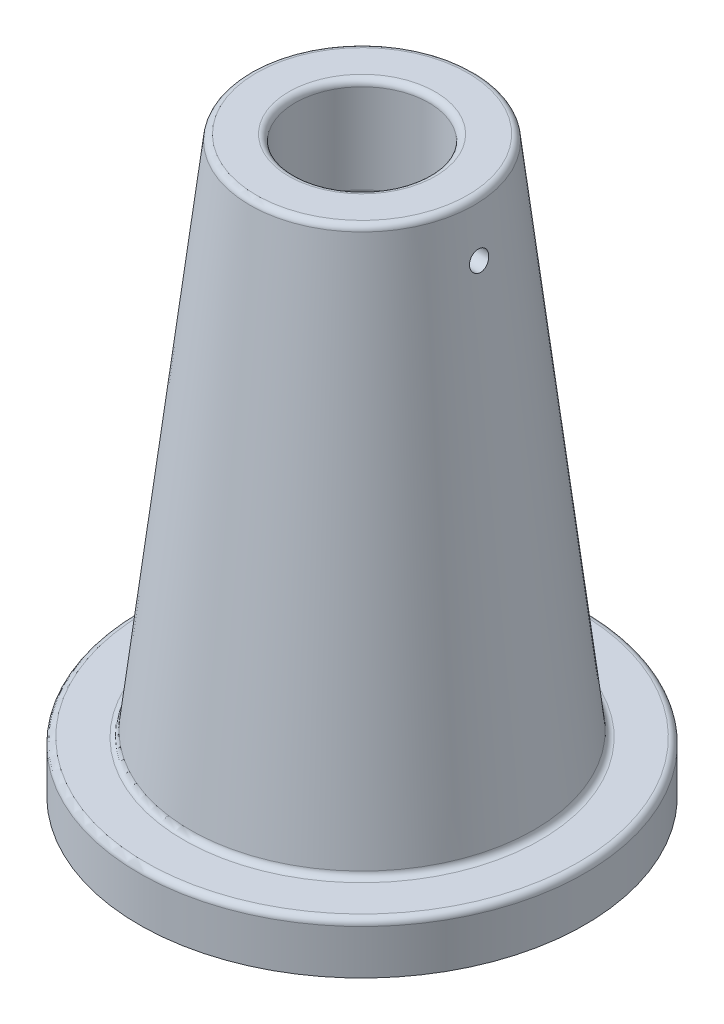
ISO-10303-21;
HEADER;
FILE_DESCRIPTION(('STEP AP214'),'2;1');
FILE_NAME('part.step','',(''),(''),'','','');
FILE_SCHEMA(('AUTOMOTIVE_DESIGN { 1 0 10303 214 1 1 1 1 }'));
ENDSEC;
DATA;
#1=APPLICATION_CONTEXT('core data for automotive mechanical design processes');
#2=APPLICATION_PROTOCOL_DEFINITION('international standard','automotive_design',2000,#1);
#3=PRODUCT_CONTEXT('',#1,'mechanical');
#4=PRODUCT('Part','Part','',(#3));
#5=PRODUCT_RELATED_PRODUCT_CATEGORY('part','',(#4));
#6=PRODUCT_DEFINITION_FORMATION('','',#4);
#7=PRODUCT_DEFINITION_CONTEXT('part definition',#1,'design');
#8=PRODUCT_DEFINITION('design','',#6,#7);
#9=PRODUCT_DEFINITION_SHAPE('','',#8);
#10=(LENGTH_UNIT() NAMED_UNIT(*) SI_UNIT(.MILLI.,.METRE.));
#11=(NAMED_UNIT(*) PLANE_ANGLE_UNIT() SI_UNIT($,.RADIAN.));
#12=(NAMED_UNIT(*) SI_UNIT($,.STERADIAN.) SOLID_ANGLE_UNIT());
#13=UNCERTAINTY_MEASURE_WITH_UNIT(LENGTH_MEASURE(1.E-05),#10,'distance_accuracy_value','');
#14=(GEOMETRIC_REPRESENTATION_CONTEXT(3) GLOBAL_UNCERTAINTY_ASSIGNED_CONTEXT((#13)) GLOBAL_UNIT_ASSIGNED_CONTEXT((#10,
#11,#12)) REPRESENTATION_CONTEXT('',''));
#15=CARTESIAN_POINT('',(0.,0.,0.));
#16=DIRECTION('',(0.,0.,1.));
#17=DIRECTION('',(1.,0.,0.));
#18=AXIS2_PLACEMENT_3D('',#15,#16,#17);
#19=CARTESIAN_POINT('',(0.,180.,0.));
#20=DIRECTION('',(0.,-1.,0.));
#21=DIRECTION('',(1.,0.,0.));
#22=AXIS2_PLACEMENT_3D('',#19,#20,#21);
#23=CONICAL_SURFACE('',#22,35.,0.116478140094217);
#24=CARTESIAN_POINT('',(0.,17.7675701216717,0.));
#25=DIRECTION('',(0.,-1.,0.));
#26=DIRECTION('',(1.,0.,0.));
#27=AXIS2_PLACEMENT_3D('',#24,#25,#26);
#28=CIRCLE('',#27,53.9824554264844);
#29=CARTESIAN_POINT('',(53.9824554264844,17.7675701216717,0.));
#30=VERTEX_POINT('',#29);
#31=EDGE_CURVE('E10',#30,#30,#28,.F.);
#32=ORIENTED_EDGE('',*,*,#31,.T.);
#33=EDGE_LOOP('',(#32));
#34=FACE_BOUND('',#33,.T.);
#35=CARTESIAN_POINT('',(0.,178.232429878328,0.));
#36=DIRECTION('',(0.,1.,0.));
#37=DIRECTION('',(-1.,0.,0.));
#38=AXIS2_PLACEMENT_3D('',#35,#36,#37);
#39=CIRCLE('',#38,35.2068194446263);
#40=CARTESIAN_POINT('',(-35.2068194446264,178.232429878328,0.));
#41=VERTEX_POINT('',#40);
#42=EDGE_CURVE('E44',#41,#41,#39,.F.);
#43=ORIENTED_EDGE('',*,*,#42,.T.);
#44=EDGE_LOOP('',(#43));
#45=FACE_BOUND('',#44,.T.);
#46=CARTESIAN_POINT('',(37.1195287037183,161.544046174723,-1.72287283645094));
#47=CARTESIAN_POINT('',(37.1370110141704,161.448667116111,-1.58689874380594));
#48=CARTESIAN_POINT('',(37.1528076429948,161.364442769678,-1.44275699277994));
#49=CARTESIAN_POINT('',(37.1800718568324,161.220883186217,-1.14206506275258));
#50=CARTESIAN_POINT('',(37.1915354072956,161.161571139466,-0.985503482852251));
#51=CARTESIAN_POINT('',(37.2094043683002,161.069731522951,-0.664384702451008));
#52=CARTESIAN_POINT('',(37.2158089231903,161.037208484097,-0.499826154379789));
#53=CARTESIAN_POINT('',(37.2231394596646,161.000018150022,-0.167507186579219));
#54=CARTESIAN_POINT('',(37.2240667284955,160.995344309809,0.000252471541381012));
#55=CARTESIAN_POINT('',(37.2204024855878,161.013900202914,0.332690136014836));
#56=CARTESIAN_POINT('',(37.2158588676727,161.036887778591,0.497382253536511));
#57=CARTESIAN_POINT('',(37.2016232561636,161.109637827107,0.820509060427897));
#58=CARTESIAN_POINT('',(37.1919310868643,161.159401213729,0.978943536043867));
#59=CARTESIAN_POINT('',(37.1679763085755,161.284308456691,1.2854852897461));
#60=CARTESIAN_POINT('',(37.1537039650398,161.35950638929,1.43356974645748));
#61=CARTESIAN_POINT('',(37.1214506252923,161.533029867042,1.71505123867367));
#62=CARTESIAN_POINT('',(37.1034693503597,161.63135715041,1.84844716920082));
#63=CARTESIAN_POINT('',(37.0645272496727,161.849990756925,2.09893036350318));
#64=CARTESIAN_POINT('',(37.0435256608058,161.970605543919,2.21574202003833));
#65=CARTESIAN_POINT('',(36.9999015094385,162.229416713766,2.42755090189932));
#66=CARTESIAN_POINT('',(36.9772788065398,162.367614620229,2.52254623479502));
#67=CARTESIAN_POINT('',(36.9312194794563,162.659977865549,2.6894399098405));
#68=CARTESIAN_POINT('',(36.9077757642353,162.814349274428,2.76097555881078));
#69=CARTESIAN_POINT('',(36.8615115870054,163.133034484778,2.87699983738788));
#70=CARTESIAN_POINT('',(36.8386911428328,163.297348570349,2.92148769373635));
#71=CARTESIAN_POINT('',(36.7945494894836,163.631930005524,2.98220233597654));
#72=CARTESIAN_POINT('',(36.7732338389751,163.802216270673,2.99832911566572));
#73=CARTESIAN_POINT('',(36.7329355023764,164.143331352233,3.00142379082487));
#74=CARTESIAN_POINT('',(36.7139527283342,164.31416014794,2.98839278593058));
#75=CARTESIAN_POINT('',(36.6789238812265,164.650223263936,2.93359725533705));
#76=CARTESIAN_POINT('',(36.6628582827522,164.815488253205,2.8920334059748));
#77=CARTESIAN_POINT('',(36.6337042033163,165.136840437871,2.78144988759185));
#78=CARTESIAN_POINT('',(36.6206155834114,165.292928061346,2.71243150035874));
#79=CARTESIAN_POINT('',(36.5974623290919,165.590069757848,2.54953824349799));
#80=CARTESIAN_POINT('',(36.5873731996491,165.731239174763,2.45587719676131));
#81=CARTESIAN_POINT('',(36.5698232073608,165.995923724751,2.24606460642692));
#82=CARTESIAN_POINT('',(36.5623622888959,166.11943923139,2.12991353885382));
#83=CARTESIAN_POINT('',(36.5497147573477,166.344797295062,1.87890082820036));
#84=CARTESIAN_POINT('',(36.5445196756086,166.446719808891,1.74411137982925));
#85=CARTESIAN_POINT('',(36.5359409479399,166.62654979379,1.45931421451841));
#86=CARTESIAN_POINT('',(36.5325572993548,166.704457300063,1.30930651988713));
#87=CARTESIAN_POINT('',(36.5272109497271,166.834022080924,0.998342965294474));
#88=CARTESIAN_POINT('',(36.5252481496774,166.885681184469,0.837387869021582));
#89=CARTESIAN_POINT('',(36.5224515711374,166.961284627812,0.509085595260116));
#90=CARTESIAN_POINT('',(36.5216177961011,166.985228882824,0.341738398218662));
#91=CARTESIAN_POINT('',(36.520935200251,167.004726697664,0.00529496317647928));
#92=CARTESIAN_POINT('',(36.5210869716184,167.000263188271,-0.163802265430194));
#93=CARTESIAN_POINT('',(36.5224041216861,166.963032429132,-0.498848003921515));
#94=CARTESIAN_POINT('',(36.5235695026616,166.930265115856,-0.664796506737668));
#95=CARTESIAN_POINT('',(36.5271083953451,166.837355228084,-0.98885266056172));
#96=CARTESIAN_POINT('',(36.5294820486821,166.777209444477,-1.1469593900025));
#97=CARTESIAN_POINT('',(36.535767231822,166.631261224011,-1.45081754963313));
#98=CARTESIAN_POINT('',(36.5396787539933,166.545458914473,-1.59656904113123));
#99=CARTESIAN_POINT('',(36.5494469072692,166.350702900898,-1.87151392836735));
#100=CARTESIAN_POINT('',(36.5553026890307,166.241759313521,-2.00071452021506));
#101=CARTESIAN_POINT('',(36.5693754419158,166.003837773683,-2.23896770527406));
#102=CARTESIAN_POINT('',(36.577592390578,165.874860011809,-2.34802049013255));
#103=CARTESIAN_POINT('',(36.5967245677539,165.600668044373,-2.54285926079753));
#104=CARTESIAN_POINT('',(36.6076384066268,165.455462221769,-2.62865718166677));
#105=CARTESIAN_POINT('',(36.6323576442558,165.152951084044,-2.77469178227036));
#106=CARTESIAN_POINT('',(36.6461630504673,164.995645737729,-2.83492839609791));
#107=CARTESIAN_POINT('',(36.6766733965209,164.673148300885,-2.92832819673883));
#108=CARTESIAN_POINT('',(36.6933836361169,164.507942202203,-2.96144125574067));
#109=CARTESIAN_POINT('',(36.7294159372367,164.174608393723,-2.999609380185));
#110=CARTESIAN_POINT('',(36.7487380001675,164.006480682352,-3.00466443051194));
#111=CARTESIAN_POINT('',(36.7896029410071,163.670882224423,-2.98665483596641));
#112=CARTESIAN_POINT('',(36.8111596650992,163.503423182112,-2.963403943892));
#113=CARTESIAN_POINT('',(36.8556148823772,163.174893564645,-2.88921541670958));
#114=CARTESIAN_POINT('',(36.8785137589471,163.013824837123,-2.83826983592553));
#115=CARTESIAN_POINT('',(36.9248825047814,162.701109465887,-2.70956553954884));
#116=CARTESIAN_POINT('',(36.9483556910158,162.54956330393,-2.63156410898574));
#117=CARTESIAN_POINT('',(36.994504176879,162.261866000651,-2.45105500039912));
#118=CARTESIAN_POINT('',(37.0171803005256,162.125698617536,-2.34857353943751));
#119=CARTESIAN_POINT('',(37.0534421844104,161.913932279665,-2.1590341275262));
#120=CARTESIAN_POINT('',(37.0675782149628,161.833075503386,-2.07786882522675));
#121=CARTESIAN_POINT('',(37.0945868657502,161.681055751536,-1.90672420316846));
#122=CARTESIAN_POINT('',(37.1074594885536,161.609892756258,-1.81674490132838));
#123=CARTESIAN_POINT('',(37.1195287037183,161.544046174723,-1.72287283645094));
#124=B_SPLINE_CURVE_WITH_KNOTS('',3,(#46,#47,#48,#49,#50,#51,#52,#53,#54,#55,#56,#57,#58,#59,
#60,#61,#62,#63,#64,#65,#66,#67,#68,#69,#70,#71,#72,#73,#74,#75,#76,#77,#78,#79,#80,#81,#82,#83,
#84,#85,#86,#87,#88,#89,#90,#91,#92,#93,#94,#95,#96,#97,#98,#99,#100,#101,#102,#103,#104,#105,
#106,#107,#108,#109,#110,#111,#112,#113,#114,#115,#116,#117,#118,#119,#120,#121,#122,#123),
.UNSPECIFIED.,.T.,.F.,(4,2,2,2,2,2,2,2,2,2,2,2,2,2,2,2,2,2,2,2,2,2,2,2,2,2,2,2,2,2,2,2,2,2,2,2,
2,2,4),(0.,0.500613726178668,1.00169243466422,1.50285587478427,2.00390152909152,
2.50059258274811,2.99730058814359,3.49507135033666,3.99287953291759,4.49817843764943,
5.00352115737101,5.51634392337445,6.02918134957004,6.54382353298356,7.0584463078786,
7.56948624413856,8.08050232394933,8.58722275539364,9.0939324627467,9.59873174525197,
10.1035302877822,10.6082936517162,11.1130585598011,11.6181267919114,12.1231961577022,
12.6283247394055,13.1334508144496,13.6383565165925,14.1432574157936,14.6478986925886,
15.1525412705336,15.658114401764,16.1636878053594,16.6726058320462,17.1816699457176,
17.6954242596461,18.2086308122606,18.5542388527636,18.8998461906634),.UNSPECIFIED.);
#125=CARTESIAN_POINT('',(37.1195287037183,161.544046174723,-1.72287283645094));
#126=VERTEX_POINT('',#125);
#127=EDGE_CURVE('E90',#126,#126,#124,.T.);
#128=ORIENTED_EDGE('',*,*,#127,.T.);
#129=EDGE_LOOP('',(#128));
#130=FACE_BOUND('',#129,.T.);
#131=ADVANCED_FACE('F37',(#34,#45,#130),#23,.T.);
#132=CARTESIAN_POINT('',(0.,-0.001000000000001,0.));
#133=DIRECTION('',(0.,1.,0.));
#134=DIRECTION('',(-1.,0.,0.));
#135=AXIS2_PLACEMENT_3D('',#132,#133,#134);
#136=CYLINDRICAL_SURFACE('',#135,21.);
#137=CARTESIAN_POINT('',(0.,150.,0.));
#138=DIRECTION('',(0.,-1.,0.));
#139=DIRECTION('',(1.,0.,0.));
#140=AXIS2_PLACEMENT_3D('',#137,#138,#139);
#141=CIRCLE('',#140,21.);
#142=CARTESIAN_POINT('',(21.,150.,0.));
#143=VERTEX_POINT('',#142);
#144=EDGE_CURVE('E69',#143,#143,#141,.T.);
#145=ORIENTED_EDGE('',*,*,#144,.T.);
#146=EDGE_LOOP('',(#145));
#147=FACE_BOUND('',#146,.T.);
#148=CARTESIAN_POINT('',(0.,178.,0.));
#149=DIRECTION('',(0.,1.,0.));
#150=DIRECTION('',(-1.,0.,0.));
#151=AXIS2_PLACEMENT_3D('',#148,#149,#150);
#152=CIRCLE('',#151,21.);
#153=CARTESIAN_POINT('',(-21.,178.,0.));
#154=VERTEX_POINT('',#153);
#155=EDGE_CURVE('E72',#154,#154,#152,.T.);
#156=ORIENTED_EDGE('',*,*,#155,.T.);
#157=EDGE_LOOP('',(#156));
#158=FACE_BOUND('',#157,.T.);
#159=CARTESIAN_POINT('',(20.7846096908265,164.,3.));
#160=CARTESIAN_POINT('',(20.7846123857155,164.167586256861,2.99999301173977));
#161=CARTESIAN_POINT('',(20.7866584795961,164.335272069159,2.98590996760321));
#162=CARTESIAN_POINT('',(20.7946169869532,164.665961954635,2.92996110206816));
#163=CARTESIAN_POINT('',(20.8005332532436,164.828961193273,2.88806759432554));
#164=CARTESIAN_POINT('',(20.8155486396504,165.145443050043,2.77777108254704));
#165=CARTESIAN_POINT('',(20.8246454026143,165.298932617151,2.70938770683119));
#166=CARTESIAN_POINT('',(20.8449939989711,165.592234594202,2.54809763833815));
#167=CARTESIAN_POINT('',(20.8562455139175,165.73204902056,2.45519456851086));
#168=CARTESIAN_POINT('',(20.8797273788334,165.995072443771,2.24678020260294));
#169=CARTESIAN_POINT('',(20.8919636170909,166.118167570799,2.13112584640993));
#170=CARTESIAN_POINT('',(20.9159835467765,166.343272335861,1.88080061845072));
#171=CARTESIAN_POINT('',(20.9277672140334,166.44528084896,1.74612873277669));
#172=CARTESIAN_POINT('',(20.9496155553433,166.62573364664,1.46086557603073));
#173=CARTESIAN_POINT('',(20.9596725344021,166.704073571778,1.31020764932413));
#174=CARTESIAN_POINT('',(20.9768692717936,166.834296102992,0.99770511894464));
#175=CARTESIAN_POINT('',(20.9840091702546,166.886179979971,0.835861053058989));
#176=CARTESIAN_POINT('',(20.9945257501347,166.961673810446,0.506751095311421));
#177=CARTESIAN_POINT('',(20.9979277547716,166.985474104949,0.339529687604812));
#178=CARTESIAN_POINT('',(21.0006719322574,167.00471584785,0.00343434791759246));
#179=CARTESIAN_POINT('',(21.0000143107834,167.000158732949,-0.165439499910875));
#180=CARTESIAN_POINT('',(20.9947336419489,166.962965932676,-0.498748488278814));
#181=CARTESIAN_POINT('',(20.9901395119864,166.930535001676,-0.663206999656563));
#182=CARTESIAN_POINT('',(20.9775342811895,166.838836160451,-0.984323392693052));
#183=CARTESIAN_POINT('',(20.9695230991603,166.779567612518,-1.14098108889283));
#184=CARTESIAN_POINT('',(20.9509341055647,166.635663882825,-1.44267295015162));
#185=CARTESIAN_POINT('',(20.9403475225756,166.550941773322,-1.58766508918662));
#186=CARTESIAN_POINT('',(20.9177890004434,166.35859926089,-1.86145173020649));
#187=CARTESIAN_POINT('',(20.9058169784992,166.250977489035,-1.99024526311775));
#188=CARTESIAN_POINT('',(20.881698074157,166.014748097486,-2.22918448659579));
#189=CARTESIAN_POINT('',(20.8695505846684,165.885961800876,-2.33915353998276));
#190=CARTESIAN_POINT('',(20.8465544081349,165.611668217856,-2.53594484385186));
#191=CARTESIAN_POINT('',(20.8357057277445,165.466160845782,-2.62276697574268));
#192=CARTESIAN_POINT('',(20.8165358052438,165.162379565141,-2.77081952281193));
#193=CARTESIAN_POINT('',(20.808216236548,165.004097291176,-2.83203300377667));
#194=CARTESIAN_POINT('',(20.7950769871342,164.679353630261,-2.92695935562481));
#195=CARTESIAN_POINT('',(20.7902570837419,164.512892764413,-2.96067397620454));
#196=CARTESIAN_POINT('',(20.7847047113597,164.178085193855,-2.99940586032291));
#197=CARTESIAN_POINT('',(20.7839366580466,164.009767961007,-3.00467296656708));
#198=CARTESIAN_POINT('',(20.7864805879907,163.674653292462,-2.98702212370681));
#199=CARTESIAN_POINT('',(20.7897924567946,163.507855814265,-2.96410496525055));
#200=CARTESIAN_POINT('',(20.8000904478774,163.181281729957,-2.89094756782802));
#201=CARTESIAN_POINT('',(20.8070599701787,163.021476909402,-2.84083073766631));
#202=CARTESIAN_POINT('',(20.8238743681825,162.712536803815,-2.71482459257196));
#203=CARTESIAN_POINT('',(20.8337193736441,162.563402000657,-2.63893411455212));
#204=CARTESIAN_POINT('',(20.8552597262012,162.278912180418,-2.46293040496839));
#205=CARTESIAN_POINT('',(20.8669672867845,162.143658558181,-2.36265480040688));
#206=CARTESIAN_POINT('',(20.8908763629888,161.891810414562,-2.14095416732048));
#207=CARTESIAN_POINT('',(20.9030779038442,161.775216847911,-2.01952805730327));
#208=CARTESIAN_POINT('',(20.9267107862086,161.563107172349,-1.75787562942804));
#209=CARTESIAN_POINT('',(20.9381356434277,161.467756216521,-1.6175147581865));
#210=CARTESIAN_POINT('',(20.958828323397,161.301986655296,-1.32262305715679));
#211=CARTESIAN_POINT('',(20.9680962006073,161.231567420393,-1.16809258526469));
#212=CARTESIAN_POINT('',(20.9834021676666,161.117926828526,-0.849773886890901));
#213=CARTESIAN_POINT('',(20.9894511548583,161.074613617059,-0.686018998685893));
#214=CARTESIAN_POINT('',(20.9976833867479,161.01611679934,-0.35346788856867));
#215=CARTESIAN_POINT('',(20.9998668620287,161.000931515219,-0.184671967971405));
#216=CARTESIAN_POINT('',(21.0001201150786,160.999159641583,0.151564695940743));
#217=CARTESIAN_POINT('',(20.9982263253354,161.012319771472,0.319004132625873));
#218=CARTESIAN_POINT('',(20.9906109641261,161.066324225065,0.64926395021983));
#219=CARTESIAN_POINT('',(20.9848894016975,161.107168483406,0.812084342033221));
#220=CARTESIAN_POINT('',(20.9702583308119,161.215294966142,1.12842557174584));
#221=CARTESIAN_POINT('',(20.9613507422877,161.282561270727,1.28195194531031));
#222=CARTESIAN_POINT('',(20.9413284015416,161.441595723803,1.57557855877741));
#223=CARTESIAN_POINT('',(20.9302135911925,161.533364517588,1.71567844495049));
#224=CARTESIAN_POINT('',(20.9068957119248,161.739721572834,1.97976292440333));
#225=CARTESIAN_POINT('',(20.8946841877839,161.854497360244,2.10360024947733));
#226=CARTESIAN_POINT('',(20.8706133514946,162.103216340358,2.33035075091111));
#227=CARTESIAN_POINT('',(20.8587541228549,162.237164034514,2.43325899947014));
#228=CARTESIAN_POINT('',(20.8366663173949,162.521218157487,2.61569285212654));
#229=CARTESIAN_POINT('',(20.8264463089837,162.671403035551,2.69509731448366));
#230=CARTESIAN_POINT('',(20.8088944206521,162.983048444841,2.82743853757528));
#231=CARTESIAN_POINT('',(20.8015595012655,163.144496897459,2.88040316882488));
#232=CARTESIAN_POINT('',(20.7923293834765,163.422254638755,2.94613882748796));
#233=CARTESIAN_POINT('',(20.7894495598981,163.536836503118,2.96630643794416));
#234=CARTESIAN_POINT('',(20.7855887896874,163.767596295446,2.99323937262699));
#235=CARTESIAN_POINT('',(20.784607821845,163.883774205568,3.00000484655552));
#236=CARTESIAN_POINT('',(20.7846096908265,164.,3.));
#237=B_SPLINE_CURVE_WITH_KNOTS('',3,(#159,#160,#161,#162,#163,#164,#165,#166,#167,#168,#169,
#170,#171,#172,#173,#174,#175,#176,#177,#178,#179,#180,#181,#182,#183,#184,#185,#186,#187,#188,
#189,#190,#191,#192,#193,#194,#195,#196,#197,#198,#199,#200,#201,#202,#203,#204,#205,#206,#207,
#208,#209,#210,#211,#212,#213,#214,#215,#216,#217,#218,#219,#220,#221,#222,#223,#224,#225,#226,
#227,#228,#229,#230,#231,#232,#233,#234,#235,#236),.UNSPECIFIED.,.T.,.F.,(4,2,2,2,2,2,2,2,2,2,2,
2,2,2,2,2,2,2,2,2,2,2,2,2,2,2,2,2,2,2,2,2,2,2,2,2,2,2,4),(0.,0.502334024113471,1.00516889178943,
1.5076318820904,2.01002067162463,2.51567573473529,3.02135776671807,3.52923796014006,
4.03709375356531,4.54148733207928,5.0458553561715,5.54654977361164,6.04725608903568,
6.54969221462082,7.05215838391562,7.55910776979365,8.06605975293417,8.57334643996607,
9.08060084686316,9.58339291623839,10.0861708811986,10.5866865120645,11.0872247326969,
11.5911918151719,12.095184674649,12.6029688228325,13.1107401489249,13.6167813320836,
14.1227923282126,14.624300629561,15.1258077468585,15.6270131584669,16.1282317710298,
16.63371523963,17.1393175880744,17.6474822327285,18.1551100783565,18.5034967795013,
18.8518795891438),.UNSPECIFIED.);
#238=CARTESIAN_POINT('',(20.7846096908265,164.,3.));
#239=VERTEX_POINT('',#238);
#240=EDGE_CURVE('E82',#239,#239,#237,.T.);
#241=ORIENTED_EDGE('',*,*,#240,.F.);
#242=EDGE_LOOP('',(#241));
#243=FACE_BOUND('',#242,.T.);
#244=ADVANCED_FACE('F92',(#147,#158,#243),#136,.F.);
#245=CARTESIAN_POINT('',(-35.,180.,0.));
#246=DIRECTION('',(0.,1.,0.));
#247=DIRECTION('',(-1.,0.,0.));
#248=AXIS2_PLACEMENT_3D('',#245,#246,#247);
#249=PLANE('',#248);
#250=CARTESIAN_POINT('',(0.,180.,0.));
#251=DIRECTION('',(0.,1.,0.));
#252=DIRECTION('',(-1.,0.,0.));
#253=AXIS2_PLACEMENT_3D('',#250,#251,#252);
#254=CIRCLE('',#253,23.);
#255=CARTESIAN_POINT('',(-23.,180.,0.));
#256=VERTEX_POINT('',#255);
#257=EDGE_CURVE('E63',#256,#256,#254,.F.);
#258=ORIENTED_EDGE('',*,*,#257,.T.);
#259=EDGE_LOOP('',(#258));
#260=FACE_BOUND('',#259,.T.);
#261=CARTESIAN_POINT('',(0.,180.,0.));
#262=DIRECTION('',(0.,1.,0.));
#263=DIRECTION('',(-1.,0.,0.));
#264=AXIS2_PLACEMENT_3D('',#261,#262,#263);
#265=CIRCLE('',#264,33.220371269702);
#266=CARTESIAN_POINT('',(-33.220371269702,180.,0.));
#267=VERTEX_POINT('',#266);
#268=EDGE_CURVE('E66',#267,#267,#265,.T.);
#269=ORIENTED_EDGE('',*,*,#268,.T.);
#270=EDGE_LOOP('',(#269));
#271=FACE_BOUND('',#270,.T.);
#272=ADVANCED_FACE('F129',(#260,#271),#249,.T.);
#273=CARTESIAN_POINT('',(0.,148.,0.));
#274=DIRECTION('',(0.,-1.,0.));
#275=DIRECTION('',(1.,0.,0.));
#276=AXIS2_PLACEMENT_3D('',#273,#274,#275);
#277=PLANE('',#276);
#278=CARTESIAN_POINT('',(0.,148.,0.));
#279=DIRECTION('',(0.,-1.,0.));
#280=DIRECTION('',(1.,0.,0.));
#281=AXIS2_PLACEMENT_3D('',#278,#279,#280);
#282=CIRCLE('',#281,23.);
#283=CARTESIAN_POINT('',(23.,148.,0.));
#284=VERTEX_POINT('',#283);
#285=EDGE_CURVE('E75',#284,#284,#282,.F.);
#286=ORIENTED_EDGE('',*,*,#285,.T.);
#287=EDGE_LOOP('',(#286));
#288=FACE_BOUND('',#287,.T.);
#289=CARTESIAN_POINT('',(0.,148.,0.));
#290=DIRECTION('',(0.,-1.,0.));
#291=DIRECTION('',(1.,0.,0.));
#292=AXIS2_PLACEMENT_3D('',#289,#290,#291);
#293=CIRCLE('',#292,27.9032207762606);
#294=CARTESIAN_POINT('',(27.9032207762606,148.,0.));
#295=VERTEX_POINT('',#294);
#296=EDGE_CURVE('E78',#295,#295,#293,.T.);
#297=ORIENTED_EDGE('',*,*,#296,.T.);
#298=EDGE_LOOP('',(#297));
#299=FACE_BOUND('',#298,.T.);
#300=ADVANCED_FACE('F125',(#288,#299),#277,.T.);
#301=CARTESIAN_POINT('',(0.,0.,0.));
#302=DIRECTION('',(0.,-1.,0.));
#303=DIRECTION('',(1.,0.,0.));
#304=AXIS2_PLACEMENT_3D('',#301,#302,#303);
#305=CONICAL_SURFACE('',#304,47.,0.116478140094217);
#306=CARTESIAN_POINT('',(0.,146.232429878328,0.));
#307=DIRECTION('',(0.,-1.,0.));
#308=DIRECTION('',(1.,0.,0.));
#309=AXIS2_PLACEMENT_3D('',#306,#307,#308);
#310=CIRCLE('',#309,29.889668951185);
#311=CARTESIAN_POINT('',(29.889668951185,146.232429878328,0.));
#312=VERTEX_POINT('',#311);
#313=EDGE_CURVE('E60',#312,#312,#310,.F.);
#314=ORIENTED_EDGE('',*,*,#313,.T.);
#315=EDGE_LOOP('',(#314));
#316=FACE_BOUND('',#315,.T.);
#317=CARTESIAN_POINT('',(0.,0.,0.));
#318=DIRECTION('',(0.,1.,0.));
#319=DIRECTION('',(-1.,0.,0.));
#320=AXIS2_PLACEMENT_3D('',#317,#318,#319);
#321=CIRCLE('',#320,47.);
#322=CARTESIAN_POINT('',(-47.,0.,0.));
#323=VERTEX_POINT('',#322);
#324=EDGE_CURVE('E81',#323,#323,#321,.T.);
#325=ORIENTED_EDGE('',*,*,#324,.F.);
#326=EDGE_LOOP('',(#325));
#327=FACE_BOUND('',#326,.T.);
#328=ADVANCED_FACE('F121',(#316,#327),#305,.F.);
#329=CARTESIAN_POINT('',(-47.,0.,0.));
#330=DIRECTION('',(0.,-1.,0.));
#331=DIRECTION('',(1.,0.,0.));
#332=AXIS2_PLACEMENT_3D('',#329,#330,#331);
#333=PLANE('',#332);
#334=ORIENTED_EDGE('',*,*,#324,.T.);
#335=EDGE_LOOP('',(#334));
#336=FACE_BOUND('',#335,.T.);
#337=CARTESIAN_POINT('',(0.,0.,0.));
#338=DIRECTION('',(0.,1.,0.));
#339=DIRECTION('',(-1.,0.,0.));
#340=AXIS2_PLACEMENT_3D('',#337,#338,#339);
#341=CIRCLE('',#340,70.);
#342=CARTESIAN_POINT('',(-70.,0.,0.));
#343=VERTEX_POINT('',#342);
#344=EDGE_CURVE('E107',#343,#343,#341,.T.);
#345=ORIENTED_EDGE('',*,*,#344,.F.);
#346=EDGE_LOOP('',(#345));
#347=FACE_BOUND('',#346,.T.);
#348=ADVANCED_FACE('F117',(#336,#347),#333,.T.);
#349=CARTESIAN_POINT('',(0.,180.,0.));
#350=DIRECTION('',(0.,1.,0.));
#351=DIRECTION('',(-1.,0.,0.));
#352=AXIS2_PLACEMENT_3D('',#349,#350,#351);
#353=CYLINDRICAL_SURFACE('',#352,70.);
#354=CARTESIAN_POINT('',(0.,14.,0.));
#355=DIRECTION('',(0.,1.,0.));
#356=DIRECTION('',(-1.,0.,0.));
#357=AXIS2_PLACEMENT_3D('',#354,#355,#356);
#358=CIRCLE('',#357,70.);
#359=CARTESIAN_POINT('',(-70.,14.,0.));
#360=VERTEX_POINT('',#359);
#361=EDGE_CURVE('E48',#360,#360,#358,.F.);
#362=ORIENTED_EDGE('',*,*,#361,.T.);
#363=EDGE_LOOP('',(#362));
#364=FACE_BOUND('',#363,.T.);
#365=ORIENTED_EDGE('',*,*,#344,.T.);
#366=EDGE_LOOP('',(#365));
#367=FACE_BOUND('',#366,.T.);
#368=ADVANCED_FACE('F113',(#364,#367),#353,.T.);
#369=CARTESIAN_POINT('',(-70.,16.,0.));
#370=DIRECTION('',(0.,1.,0.));
#371=DIRECTION('',(-1.,0.,0.));
#372=AXIS2_PLACEMENT_3D('',#369,#370,#371);
#373=PLANE('',#372);
#374=CARTESIAN_POINT('',(0.,16.,0.));
#375=DIRECTION('',(0.,1.,0.));
#376=DIRECTION('',(-1.,0.,0.));
#377=AXIS2_PLACEMENT_3D('',#374,#375,#376);
#378=CIRCLE('',#377,68.);
#379=CARTESIAN_POINT('',(-68.,16.,0.));
#380=VERTEX_POINT('',#379);
#381=EDGE_CURVE('E52',#380,#380,#378,.T.);
#382=ORIENTED_EDGE('',*,*,#381,.T.);
#383=EDGE_LOOP('',(#382));
#384=FACE_BOUND('',#383,.T.);
#385=CARTESIAN_POINT('',(0.,16.,0.));
#386=DIRECTION('',(0.,1.,0.));
#387=DIRECTION('',(-1.,0.,0.));
#388=AXIS2_PLACEMENT_3D('',#385,#386,#387);
#389=CIRCLE('',#388,55.9689036014087);
#390=CARTESIAN_POINT('',(-55.9689036014087,16.,0.));
#391=VERTEX_POINT('',#390);
#392=EDGE_CURVE('E57',#391,#391,#389,.F.);
#393=ORIENTED_EDGE('',*,*,#392,.T.);
#394=EDGE_LOOP('',(#393));
#395=FACE_BOUND('',#394,.T.);
#396=ADVANCED_FACE('F99',(#384,#395),#373,.T.);
#397=CARTESIAN_POINT('',(70.0000000000001,164.,0.));
#398=DIRECTION('',(-1.,0.,0.));
#399=DIRECTION('',(0.,0.,1.));
#400=AXIS2_PLACEMENT_3D('',#397,#398,#399);
#401=CYLINDRICAL_SURFACE('',#400,3.);
#402=ORIENTED_EDGE('',*,*,#127,.F.);
#403=EDGE_LOOP('',(#402));
#404=FACE_BOUND('',#403,.T.);
#405=ORIENTED_EDGE('',*,*,#240,.T.);
#406=EDGE_LOOP('',(#405));
#407=FACE_BOUND('',#406,.T.);
#408=ADVANCED_FACE('F95',(#404,#407),#401,.F.);
#409=CARTESIAN_POINT('',(0.,150.,0.));
#410=DIRECTION('',(0.,-1.,0.));
#411=DIRECTION('',(1.,0.,0.));
#412=AXIS2_PLACEMENT_3D('',#409,#410,#411);
#413=TOROIDAL_SURFACE('',#412,23.,2.);
#414=ORIENTED_EDGE('',*,*,#144,.F.);
#415=EDGE_LOOP('',(#414));
#416=FACE_BOUND('',#415,.T.);
#417=ORIENTED_EDGE('',*,*,#285,.F.);
#418=EDGE_LOOP('',(#417));
#419=FACE_BOUND('',#418,.T.);
#420=ADVANCED_FACE('F98',(#416,#419),#413,.T.);
#421=CARTESIAN_POINT('',(0.,178.,0.));
#422=DIRECTION('',(0.,1.,0.));
#423=DIRECTION('',(-1.,0.,0.));
#424=AXIS2_PLACEMENT_3D('',#421,#422,#423);
#425=TOROIDAL_SURFACE('',#424,23.,2.);
#426=ORIENTED_EDGE('',*,*,#257,.F.);
#427=EDGE_LOOP('',(#426));
#428=FACE_BOUND('',#427,.T.);
#429=ORIENTED_EDGE('',*,*,#155,.F.);
#430=EDGE_LOOP('',(#429));
#431=FACE_BOUND('',#430,.T.);
#432=ADVANCED_FACE('F136',(#428,#431),#425,.T.);
#433=CARTESIAN_POINT('',(0.,146.,0.));
#434=DIRECTION('',(0.,-1.,0.));
#435=DIRECTION('',(1.,0.,0.));
#436=AXIS2_PLACEMENT_3D('',#433,#434,#435);
#437=TOROIDAL_SURFACE('',#436,27.9032207762606,2.);
#438=ORIENTED_EDGE('',*,*,#296,.F.);
#439=EDGE_LOOP('',(#438));
#440=FACE_BOUND('',#439,.T.);
#441=ORIENTED_EDGE('',*,*,#313,.F.);
#442=EDGE_LOOP('',(#441));
#443=FACE_BOUND('',#442,.T.);
#444=ADVANCED_FACE('F140',(#440,#443),#437,.F.);
#445=CARTESIAN_POINT('',(0.,14.,0.));
#446=DIRECTION('',(0.,1.,0.));
#447=DIRECTION('',(-1.,0.,0.));
#448=AXIS2_PLACEMENT_3D('',#445,#446,#447);
#449=TOROIDAL_SURFACE('',#448,68.,2.);
#450=ORIENTED_EDGE('',*,*,#361,.F.);
#451=EDGE_LOOP('',(#450));
#452=FACE_BOUND('',#451,.T.);
#453=ORIENTED_EDGE('',*,*,#381,.F.);
#454=EDGE_LOOP('',(#453));
#455=FACE_BOUND('',#454,.T.);
#456=ADVANCED_FACE('F144',(#452,#455),#449,.T.);
#457=CARTESIAN_POINT('',(0.,18.,0.));
#458=DIRECTION('',(0.,1.,0.));
#459=DIRECTION('',(-1.,0.,0.));
#460=AXIS2_PLACEMENT_3D('',#457,#458,#459);
#461=TOROIDAL_SURFACE('',#460,55.9689036014087,2.);
#462=ORIENTED_EDGE('',*,*,#392,.F.);
#463=EDGE_LOOP('',(#462));
#464=FACE_BOUND('',#463,.T.);
#465=ORIENTED_EDGE('',*,*,#31,.F.);
#466=EDGE_LOOP('',(#465));
#467=FACE_BOUND('',#466,.T.);
#468=ADVANCED_FACE('F147',(#464,#467),#461,.F.);
#469=CARTESIAN_POINT('',(0.,178.,0.));
#470=DIRECTION('',(0.,1.,0.));
#471=DIRECTION('',(-1.,0.,0.));
#472=AXIS2_PLACEMENT_3D('',#469,#470,#471);
#473=TOROIDAL_SURFACE('',#472,33.220371269702,2.);
#474=ORIENTED_EDGE('',*,*,#42,.F.);
#475=EDGE_LOOP('',(#474));
#476=FACE_BOUND('',#475,.T.);
#477=ORIENTED_EDGE('',*,*,#268,.F.);
#478=EDGE_LOOP('',(#477));
#479=FACE_BOUND('',#478,.T.);
#480=ADVANCED_FACE('F39',(#476,#479),#473,.T.);
#481=CLOSED_SHELL('',(#131,#244,#272,#300,#328,#348,#368,#396,#408,#420,#432,#444,#456,#468,#480));
#482=MANIFOLD_SOLID_BREP('B2',#481);
#483=ADVANCED_BREP_SHAPE_REPRESENTATION('',(#18,#482),#14);
#484=SHAPE_DEFINITION_REPRESENTATION(#9,#483);
ENDSEC;
END-ISO-10303-21;
